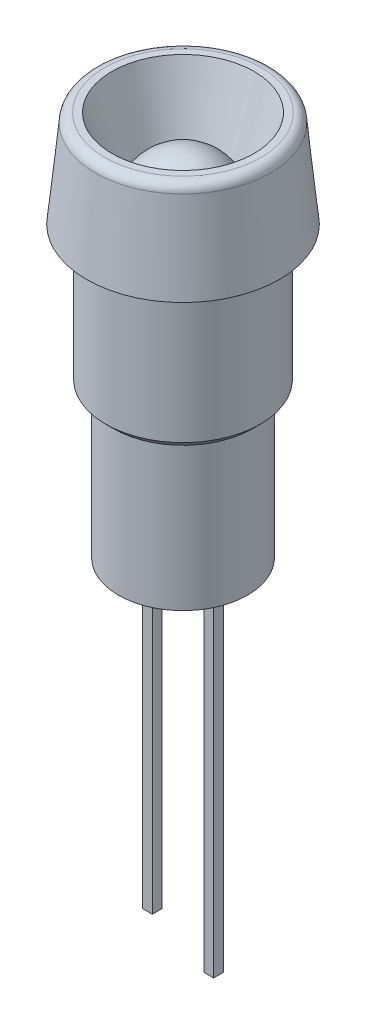
ISO-10303-21;
HEADER;
FILE_DESCRIPTION(('STEP AP214'),'2;1');
FILE_NAME('part.step','',(''),(''),'','','');
FILE_SCHEMA(('AUTOMOTIVE_DESIGN { 1 0 10303 214 1 1 1 1 }'));
ENDSEC;
DATA;
#1=APPLICATION_CONTEXT('core data for automotive mechanical design processes');
#2=APPLICATION_PROTOCOL_DEFINITION('international standard','automotive_design',2000,#1);
#3=PRODUCT_CONTEXT('',#1,'mechanical');
#4=PRODUCT('Part','Part','',(#3));
#5=PRODUCT_RELATED_PRODUCT_CATEGORY('part','',(#4));
#6=PRODUCT_DEFINITION_FORMATION('','',#4);
#7=PRODUCT_DEFINITION_CONTEXT('part definition',#1,'design');
#8=PRODUCT_DEFINITION('design','',#6,#7);
#9=PRODUCT_DEFINITION_SHAPE('','',#8);
#10=(LENGTH_UNIT() NAMED_UNIT(*) SI_UNIT(.MILLI.,.METRE.));
#11=(NAMED_UNIT(*) PLANE_ANGLE_UNIT() SI_UNIT($,.RADIAN.));
#12=(NAMED_UNIT(*) SI_UNIT($,.STERADIAN.) SOLID_ANGLE_UNIT());
#13=UNCERTAINTY_MEASURE_WITH_UNIT(LENGTH_MEASURE(1.E-05),#10,'distance_accuracy_value','');
#14=(GEOMETRIC_REPRESENTATION_CONTEXT(3) GLOBAL_UNCERTAINTY_ASSIGNED_CONTEXT((#13)) GLOBAL_UNIT_ASSIGNED_CONTEXT((#10,
#11,#12)) REPRESENTATION_CONTEXT('',''));
#15=CARTESIAN_POINT('',(0.,0.,0.));
#16=DIRECTION('',(0.,0.,1.));
#17=DIRECTION('',(1.,0.,0.));
#18=AXIS2_PLACEMENT_3D('',#15,#16,#17);
#19=CARTESIAN_POINT('',(0.,-16.51,0.));
#20=DIRECTION('',(0.,-1.,0.));
#21=DIRECTION('',(0.,0.,-1.));
#22=AXIS2_PLACEMENT_3D('',#19,#20,#21);
#23=PLANE('',#22);
#24=DIRECTION('',(0.,0.,-1.));
#25=VECTOR('',#24,1.);
#26=CARTESIAN_POINT('',(-1.84149999999992,-16.51,0.254));
#27=LINE('',#26,#25);
#28=CARTESIAN_POINT('',(-1.84149999999992,-16.51,0.254));
#29=VERTEX_POINT('',#28);
#30=CARTESIAN_POINT('',(-1.84149999999992,-16.51,-0.254));
#31=VERTEX_POINT('',#30);
#32=EDGE_CURVE('E186',#29,#31,#27,.T.);
#33=ORIENTED_EDGE('',*,*,#32,.T.);
#34=DIRECTION('',(1.,0.,0.));
#35=VECTOR('',#34,1.);
#36=CARTESIAN_POINT('',(-1.84149999999992,-16.51,-0.254));
#37=LINE('',#36,#35);
#38=CARTESIAN_POINT('',(-1.33349999999992,-16.51,-0.254));
#39=VERTEX_POINT('',#38);
#40=EDGE_CURVE('E169',#31,#39,#37,.T.);
#41=ORIENTED_EDGE('',*,*,#40,.T.);
#42=DIRECTION('',(0.,0.,1.));
#43=VECTOR('',#42,1.);
#44=CARTESIAN_POINT('',(-1.33349999999992,-16.51,0.254));
#45=LINE('',#44,#43);
#46=CARTESIAN_POINT('',(-1.33349999999992,-16.51,0.254));
#47=VERTEX_POINT('',#46);
#48=EDGE_CURVE('E27',#39,#47,#45,.T.);
#49=ORIENTED_EDGE('',*,*,#48,.T.);
#50=DIRECTION('',(-1.,0.,0.));
#51=VECTOR('',#50,1.);
#52=CARTESIAN_POINT('',(-1.84149999999992,-16.51,0.254));
#53=LINE('',#52,#51);
#54=EDGE_CURVE('E11',#47,#29,#53,.T.);
#55=ORIENTED_EDGE('',*,*,#54,.T.);
#56=EDGE_LOOP('',(#33,#41,#49,#55));
#57=FACE_BOUND('',#56,.T.);
#58=ADVANCED_FACE('F18',(#57),#23,.T.);
#59=CARTESIAN_POINT('',(-1.84149999999992,-16.51,0.254));
#60=DIRECTION('',(0.,0.,-1.));
#61=DIRECTION('',(0.,-1.,0.));
#62=AXIS2_PLACEMENT_3D('',#59,#60,#61);
#63=PLANE('',#62);
#64=DIRECTION('',(-1.,0.,0.));
#65=VECTOR('',#64,1.);
#66=CARTESIAN_POINT('',(-1.8415,0.,0.254));
#67=LINE('',#66,#65);
#68=CARTESIAN_POINT('',(-1.33349999999992,0.,0.254));
#69=VERTEX_POINT('',#68);
#70=CARTESIAN_POINT('',(-1.8415,0.,0.254));
#71=VERTEX_POINT('',#70);
#72=EDGE_CURVE('E161',#69,#71,#67,.T.);
#73=ORIENTED_EDGE('',*,*,#72,.T.);
#74=DIRECTION('',(0.,1.,0.));
#75=VECTOR('',#74,1.);
#76=CARTESIAN_POINT('',(-1.84149999999992,-16.51,0.254));
#77=LINE('',#76,#75);
#78=EDGE_CURVE('E190',#29,#71,#77,.T.);
#79=ORIENTED_EDGE('',*,*,#78,.F.);
#80=ORIENTED_EDGE('',*,*,#54,.F.);
#81=DIRECTION('',(0.,1.,0.));
#82=VECTOR('',#81,1.);
#83=CARTESIAN_POINT('',(-1.33349999999992,-16.51,0.254));
#84=LINE('',#83,#82);
#85=EDGE_CURVE('E21',#47,#69,#84,.T.);
#86=ORIENTED_EDGE('',*,*,#85,.T.);
#87=EDGE_LOOP('',(#73,#79,#80,#86));
#88=FACE_BOUND('',#87,.T.);
#89=ADVANCED_FACE('F207',(#88),#63,.F.);
#90=CARTESIAN_POINT('',(-1.33349999999992,-16.51,0.254));
#91=DIRECTION('',(-1.,0.,0.));
#92=DIRECTION('',(0.,1.,0.));
#93=AXIS2_PLACEMENT_3D('',#90,#91,#92);
#94=PLANE('',#93);
#95=DIRECTION('',(0.,0.,1.));
#96=VECTOR('',#95,1.);
#97=CARTESIAN_POINT('',(-1.3335,0.,0.254));
#98=LINE('',#97,#96);
#99=CARTESIAN_POINT('',(-1.3335,0.,-0.254));
#100=VERTEX_POINT('',#99);
#101=EDGE_CURVE('E165',#100,#69,#98,.T.);
#102=ORIENTED_EDGE('',*,*,#101,.T.);
#103=ORIENTED_EDGE('',*,*,#85,.F.);
#104=ORIENTED_EDGE('',*,*,#48,.F.);
#105=DIRECTION('',(0.,1.,0.));
#106=VECTOR('',#105,1.);
#107=CARTESIAN_POINT('',(-1.33349999999992,-16.51,-0.254));
#108=LINE('',#107,#106);
#109=EDGE_CURVE('E172',#39,#100,#108,.T.);
#110=ORIENTED_EDGE('',*,*,#109,.T.);
#111=EDGE_LOOP('',(#102,#103,#104,#110));
#112=FACE_BOUND('',#111,.T.);
#113=ADVANCED_FACE('F196',(#112),#94,.F.);
#114=CARTESIAN_POINT('',(-1.84149999999992,-16.51,-0.254));
#115=DIRECTION('',(0.,0.,1.));
#116=DIRECTION('',(1.,0.,0.));
#117=AXIS2_PLACEMENT_3D('',#114,#115,#116);
#118=PLANE('',#117);
#119=DIRECTION('',(1.,0.,0.));
#120=VECTOR('',#119,1.);
#121=CARTESIAN_POINT('',(-1.8415,0.,-0.254));
#122=LINE('',#121,#120);
#123=CARTESIAN_POINT('',(-1.8415,0.,-0.254));
#124=VERTEX_POINT('',#123);
#125=EDGE_CURVE('E126',#124,#100,#122,.T.);
#126=ORIENTED_EDGE('',*,*,#125,.T.);
#127=ORIENTED_EDGE('',*,*,#109,.F.);
#128=ORIENTED_EDGE('',*,*,#40,.F.);
#129=DIRECTION('',(0.,1.,0.));
#130=VECTOR('',#129,1.);
#131=CARTESIAN_POINT('',(-1.84149999999992,-16.51,-0.254));
#132=LINE('',#131,#130);
#133=EDGE_CURVE('E176',#31,#124,#132,.T.);
#134=ORIENTED_EDGE('',*,*,#133,.T.);
#135=EDGE_LOOP('',(#126,#127,#128,#134));
#136=FACE_BOUND('',#135,.T.);
#137=ADVANCED_FACE('F202',(#136),#118,.F.);
#138=CARTESIAN_POINT('',(-1.84149999999992,-16.51,0.254));
#139=DIRECTION('',(1.,0.,0.));
#140=DIRECTION('',(0.,1.,0.));
#141=AXIS2_PLACEMENT_3D('',#138,#139,#140);
#142=PLANE('',#141);
#143=DIRECTION('',(0.,0.,-1.));
#144=VECTOR('',#143,1.);
#145=CARTESIAN_POINT('',(-1.8415,0.,0.254));
#146=LINE('',#145,#144);
#147=EDGE_CURVE('E157',#71,#124,#146,.T.);
#148=ORIENTED_EDGE('',*,*,#147,.T.);
#149=ORIENTED_EDGE('',*,*,#133,.F.);
#150=ORIENTED_EDGE('',*,*,#32,.F.);
#151=ORIENTED_EDGE('',*,*,#78,.T.);
#152=EDGE_LOOP('',(#148,#149,#150,#151));
#153=FACE_BOUND('',#152,.T.);
#154=ADVANCED_FACE('F206',(#153),#142,.F.);
#155=CARTESIAN_POINT('',(0.,-17.78,0.));
#156=DIRECTION('',(0.,-1.,0.));
#157=DIRECTION('',(0.,0.,-1.));
#158=AXIS2_PLACEMENT_3D('',#155,#156,#157);
#159=PLANE('',#158);
#160=DIRECTION('',(0.,0.,-1.));
#161=VECTOR('',#160,1.);
#162=CARTESIAN_POINT('',(1.33350000000009,-17.78,0.254));
#163=LINE('',#162,#161);
#164=CARTESIAN_POINT('',(1.33350000000009,-17.78,0.254));
#165=VERTEX_POINT('',#164);
#166=CARTESIAN_POINT('',(1.33350000000009,-17.78,-0.254));
#167=VERTEX_POINT('',#166);
#168=EDGE_CURVE('E150',#165,#167,#163,.T.);
#169=ORIENTED_EDGE('',*,*,#168,.T.);
#170=DIRECTION('',(1.,0.,0.));
#171=VECTOR('',#170,1.);
#172=CARTESIAN_POINT('',(1.33350000000009,-17.78,-0.254));
#173=LINE('',#172,#171);
#174=CARTESIAN_POINT('',(1.84150000000008,-17.78,-0.254));
#175=VERTEX_POINT('',#174);
#176=EDGE_CURVE('E114',#167,#175,#173,.T.);
#177=ORIENTED_EDGE('',*,*,#176,.T.);
#178=DIRECTION('',(0.,0.,1.));
#179=VECTOR('',#178,1.);
#180=CARTESIAN_POINT('',(1.84150000000008,-17.78,0.254));
#181=LINE('',#180,#179);
#182=CARTESIAN_POINT('',(1.84150000000008,-17.78,0.254));
#183=VERTEX_POINT('',#182);
#184=EDGE_CURVE('E109',#175,#183,#181,.T.);
#185=ORIENTED_EDGE('',*,*,#184,.T.);
#186=DIRECTION('',(-1.,0.,0.));
#187=VECTOR('',#186,1.);
#188=CARTESIAN_POINT('',(1.33350000000009,-17.78,0.254));
#189=LINE('',#188,#187);
#190=EDGE_CURVE('E173',#183,#165,#189,.T.);
#191=ORIENTED_EDGE('',*,*,#190,.T.);
#192=EDGE_LOOP('',(#169,#177,#185,#191));
#193=FACE_BOUND('',#192,.T.);
#194=ADVANCED_FACE('F455',(#193),#159,.T.);
#195=CARTESIAN_POINT('',(1.33350000000009,-17.78,0.254));
#196=DIRECTION('',(0.,0.,-1.));
#197=DIRECTION('',(0.,-1.,0.));
#198=AXIS2_PLACEMENT_3D('',#195,#196,#197);
#199=PLANE('',#198);
#200=DIRECTION('',(-1.,0.,0.));
#201=VECTOR('',#200,1.);
#202=CARTESIAN_POINT('',(1.3335,0.,0.254));
#203=LINE('',#202,#201);
#204=CARTESIAN_POINT('',(1.84150000000008,0.,0.254));
#205=VERTEX_POINT('',#204);
#206=CARTESIAN_POINT('',(1.3335,0.,0.254));
#207=VERTEX_POINT('',#206);
#208=EDGE_CURVE('E124',#205,#207,#203,.T.);
#209=ORIENTED_EDGE('',*,*,#208,.T.);
#210=DIRECTION('',(0.,1.,0.));
#211=VECTOR('',#210,1.);
#212=CARTESIAN_POINT('',(1.33350000000009,-17.78,0.254));
#213=LINE('',#212,#211);
#214=EDGE_CURVE('E115',#165,#207,#213,.T.);
#215=ORIENTED_EDGE('',*,*,#214,.F.);
#216=ORIENTED_EDGE('',*,*,#190,.F.);
#217=DIRECTION('',(0.,1.,0.));
#218=VECTOR('',#217,1.);
#219=CARTESIAN_POINT('',(1.84150000000008,-17.78,0.254));
#220=LINE('',#219,#218);
#221=EDGE_CURVE('E181',#183,#205,#220,.T.);
#222=ORIENTED_EDGE('',*,*,#221,.T.);
#223=EDGE_LOOP('',(#209,#215,#216,#222));
#224=FACE_BOUND('',#223,.T.);
#225=ADVANCED_FACE('F447',(#224),#199,.F.);
#226=CARTESIAN_POINT('',(1.84150000000008,-17.78,0.254));
#227=DIRECTION('',(-1.,0.,0.));
#228=DIRECTION('',(0.,1.,0.));
#229=AXIS2_PLACEMENT_3D('',#226,#227,#228);
#230=PLANE('',#229);
#231=DIRECTION('',(0.,0.,1.));
#232=VECTOR('',#231,1.);
#233=CARTESIAN_POINT('',(1.8415,0.,0.254));
#234=LINE('',#233,#232);
#235=CARTESIAN_POINT('',(1.8415,0.,-0.254));
#236=VERTEX_POINT('',#235);
#237=EDGE_CURVE('E106',#236,#205,#234,.T.);
#238=ORIENTED_EDGE('',*,*,#237,.T.);
#239=ORIENTED_EDGE('',*,*,#221,.F.);
#240=ORIENTED_EDGE('',*,*,#184,.F.);
#241=DIRECTION('',(0.,1.,0.));
#242=VECTOR('',#241,1.);
#243=CARTESIAN_POINT('',(1.84150000000008,-17.78,-0.254));
#244=LINE('',#243,#242);
#245=EDGE_CURVE('E102',#175,#236,#244,.T.);
#246=ORIENTED_EDGE('',*,*,#245,.T.);
#247=EDGE_LOOP('',(#238,#239,#240,#246));
#248=FACE_BOUND('',#247,.T.);
#249=ADVANCED_FACE('F104',(#248),#230,.F.);
#250=CARTESIAN_POINT('',(1.33350000000009,-17.78,-0.254));
#251=DIRECTION('',(0.,0.,1.));
#252=DIRECTION('',(1.,0.,0.));
#253=AXIS2_PLACEMENT_3D('',#250,#251,#252);
#254=PLANE('',#253);
#255=DIRECTION('',(1.,0.,0.));
#256=VECTOR('',#255,1.);
#257=CARTESIAN_POINT('',(1.3335,0.,-0.254));
#258=LINE('',#257,#256);
#259=CARTESIAN_POINT('',(1.3335,0.,-0.254));
#260=VERTEX_POINT('',#259);
#261=EDGE_CURVE('E122',#260,#236,#258,.T.);
#262=ORIENTED_EDGE('',*,*,#261,.T.);
#263=ORIENTED_EDGE('',*,*,#245,.F.);
#264=ORIENTED_EDGE('',*,*,#176,.F.);
#265=DIRECTION('',(0.,1.,0.));
#266=VECTOR('',#265,1.);
#267=CARTESIAN_POINT('',(1.33350000000009,-17.78,-0.254));
#268=LINE('',#267,#266);
#269=EDGE_CURVE('E130',#167,#260,#268,.T.);
#270=ORIENTED_EDGE('',*,*,#269,.T.);
#271=EDGE_LOOP('',(#262,#263,#264,#270));
#272=FACE_BOUND('',#271,.T.);
#273=ADVANCED_FACE('F128',(#272),#254,.F.);
#274=CARTESIAN_POINT('',(1.33350000000009,-17.78,0.254));
#275=DIRECTION('',(1.,0.,0.));
#276=DIRECTION('',(0.,1.,0.));
#277=AXIS2_PLACEMENT_3D('',#274,#275,#276);
#278=PLANE('',#277);
#279=DIRECTION('',(0.,0.,-1.));
#280=VECTOR('',#279,1.);
#281=CARTESIAN_POINT('',(1.3335,0.,0.254));
#282=LINE('',#281,#280);
#283=EDGE_CURVE('E133',#207,#260,#282,.T.);
#284=ORIENTED_EDGE('',*,*,#283,.T.);
#285=ORIENTED_EDGE('',*,*,#269,.F.);
#286=ORIENTED_EDGE('',*,*,#168,.F.);
#287=ORIENTED_EDGE('',*,*,#214,.T.);
#288=EDGE_LOOP('',(#284,#285,#286,#287));
#289=FACE_BOUND('',#288,.T.);
#290=ADVANCED_FACE('F423',(#289),#278,.F.);
#291=CARTESIAN_POINT('',(4.00241928629269,14.9733199644002,0.));
#292=DIRECTION('',(0.,-1.,0.));
#293=DIRECTION('',(0.,0.,-1.));
#294=AXIS2_PLACEMENT_3D('',#291,#292,#293);
#295=PLANE('',#294);
#296=CARTESIAN_POINT('',(0.,14.9733199644001,0.));
#297=DIRECTION('',(0.,-1.,0.));
#298=DIRECTION('',(1.,0.,0.));
#299=AXIS2_PLACEMENT_3D('',#296,#297,#298);
#300=CIRCLE('',#299,4.00241928629276);
#301=CARTESIAN_POINT('',(4.00241928629268,14.9733199644002,0.));
#302=VERTEX_POINT('',#301);
#303=EDGE_CURVE('E134',#302,#302,#300,.T.);
#304=ORIENTED_EDGE('',*,*,#303,.F.);
#305=EDGE_LOOP('',(#304));
#306=FACE_BOUND('',#305,.T.);
#307=CARTESIAN_POINT('',(0.,14.9733199644001,0.));
#308=DIRECTION('',(0.,-1.,0.));
#309=DIRECTION('',(1.,0.,0.));
#310=AXIS2_PLACEMENT_3D('',#307,#308,#309);
#311=CIRCLE('',#310,4.99108003559997);
#312=CARTESIAN_POINT('',(4.9910800355999,14.9733199644002,0.));
#313=VERTEX_POINT('',#312);
#314=EDGE_CURVE('E252',#313,#313,#311,.T.);
#315=ORIENTED_EDGE('',*,*,#314,.T.);
#316=EDGE_LOOP('',(#315));
#317=FACE_BOUND('',#316,.T.);
#318=ADVANCED_FACE('F381',(#306,#317),#295,.T.);
#319=CARTESIAN_POINT('',(0.,19.9644,0.));
#320=DIRECTION('',(0.,1.,0.));
#321=DIRECTION('',(1.,0.,0.));
#322=AXIS2_PLACEMENT_3D('',#319,#320,#321);
#323=PLANE('',#322);
#324=CARTESIAN_POINT('',(0.,19.9644,0.));
#325=DIRECTION('',(0.,-1.,0.));
#326=DIRECTION('',(0.,0.,-1.));
#327=AXIS2_PLACEMENT_3D('',#324,#325,#326);
#328=CIRCLE('',#327,3.67970764536876);
#329=CARTESIAN_POINT('',(0.,19.9644,-3.67970764536876));
#330=VERTEX_POINT('',#329);
#331=EDGE_CURVE('E272',#330,#330,#328,.T.);
#332=ORIENTED_EDGE('',*,*,#331,.T.);
#333=EDGE_LOOP('',(#332));
#334=FACE_BOUND('',#333,.T.);
#335=CARTESIAN_POINT('',(0.,19.9644,0.));
#336=DIRECTION('',(0.,-1.,0.));
#337=DIRECTION('',(1.,0.,0.));
#338=AXIS2_PLACEMENT_3D('',#335,#336,#337);
#339=CIRCLE('',#338,4.04030003985646);
#340=CARTESIAN_POINT('',(4.04030003985636,19.9644,0.));
#341=VERTEX_POINT('',#340);
#342=EDGE_CURVE('E255',#341,#341,#339,.T.);
#343=ORIENTED_EDGE('',*,*,#342,.F.);
#344=EDGE_LOOP('',(#343));
#345=FACE_BOUND('',#344,.T.);
#346=ADVANCED_FACE('F363',(#334,#345),#323,.T.);
#347=CARTESIAN_POINT('',(3.34402362385197,7.58647998576154,0.));
#348=DIRECTION('',(0.,-1.,0.));
#349=DIRECTION('',(0.,0.,-1.));
#350=AXIS2_PLACEMENT_3D('',#347,#348,#349);
#351=PLANE('',#350);
#352=CARTESIAN_POINT('',(0.,7.58647998576152,0.));
#353=DIRECTION('',(0.,-1.,0.));
#354=DIRECTION('',(1.,0.,0.));
#355=AXIS2_PLACEMENT_3D('',#352,#353,#354);
#356=CIRCLE('',#355,3.344023623852);
#357=CARTESIAN_POINT('',(3.34402362385196,7.58647998576154,0.));
#358=VERTEX_POINT('',#357);
#359=EDGE_CURVE('E284',#358,#358,#356,.T.);
#360=ORIENTED_EDGE('',*,*,#359,.F.);
#361=EDGE_LOOP('',(#360));
#362=FACE_BOUND('',#361,.T.);
#363=CARTESIAN_POINT('',(0.,7.58647998576152,0.));
#364=DIRECTION('',(0.,-1.,0.));
#365=DIRECTION('',(1.,0.,0.));
#366=AXIS2_PLACEMENT_3D('',#363,#364,#365);
#367=CIRCLE('',#366,3.59357762563218);
#368=CARTESIAN_POINT('',(3.59357762563214,7.58647998576154,0.));
#369=VERTEX_POINT('',#368);
#370=EDGE_CURVE('E740',#369,#369,#367,.T.);
#371=ORIENTED_EDGE('',*,*,#370,.T.);
#372=EDGE_LOOP('',(#371));
#373=FACE_BOUND('',#372,.T.);
#374=ADVANCED_FACE('F359',(#362,#373),#351,.T.);
#375=CARTESIAN_POINT('',(0.,0.,0.));
#376=DIRECTION('',(0.,-1.,0.));
#377=DIRECTION('',(0.,0.,-1.));
#378=AXIS2_PLACEMENT_3D('',#375,#376,#377);
#379=PLANE('',#378);
#380=ORIENTED_EDGE('',*,*,#125,.F.);
#381=ORIENTED_EDGE('',*,*,#147,.F.);
#382=ORIENTED_EDGE('',*,*,#72,.F.);
#383=ORIENTED_EDGE('',*,*,#101,.F.);
#384=EDGE_LOOP('',(#380,#381,#382,#383));
#385=FACE_BOUND('',#384,.T.);
#386=ORIENTED_EDGE('',*,*,#261,.F.);
#387=ORIENTED_EDGE('',*,*,#283,.F.);
#388=ORIENTED_EDGE('',*,*,#208,.F.);
#389=ORIENTED_EDGE('',*,*,#237,.F.);
#390=EDGE_LOOP('',(#386,#387,#388,#389));
#391=FACE_BOUND('',#390,.T.);
#392=CARTESIAN_POINT('',(0.,0.,0.));
#393=DIRECTION('',(0.,-1.,0.));
#394=DIRECTION('',(1.,0.,0.));
#395=AXIS2_PLACEMENT_3D('',#392,#393,#394);
#396=CIRCLE('',#395,3.34402362385197);
#397=CARTESIAN_POINT('',(3.34402362385197,0.,0.));
#398=VERTEX_POINT('',#397);
#399=EDGE_CURVE('E743',#398,#398,#396,.T.);
#400=ORIENTED_EDGE('',*,*,#399,.T.);
#401=EDGE_LOOP('',(#400));
#402=FACE_BOUND('',#401,.T.);
#403=ADVANCED_FACE('F119',(#385,#391,#402),#379,.T.);
#404=CARTESIAN_POINT('',(0.,0.,0.));
#405=DIRECTION('',(0.,-1.,0.));
#406=DIRECTION('',(1.,0.,0.));
#407=AXIS2_PLACEMENT_3D('',#404,#405,#406);
#408=CYLINDRICAL_SURFACE('',#407,4.00241928629274);
#409=CARTESIAN_POINT('',(0.,7.99532164642206,0.));
#410=DIRECTION('',(0.,-1.,0.));
#411=DIRECTION('',(1.,0.,0.));
#412=AXIS2_PLACEMENT_3D('',#409,#410,#411);
#413=CIRCLE('',#412,4.00241928629273);
#414=CARTESIAN_POINT('',(4.00241928629269,7.99532164642208,0.));
#415=VERTEX_POINT('',#414);
#416=EDGE_CURVE('E143',#415,#415,#413,.T.);
#417=ORIENTED_EDGE('',*,*,#416,.F.);
#418=EDGE_LOOP('',(#417));
#419=FACE_BOUND('',#418,.T.);
#420=ORIENTED_EDGE('',*,*,#303,.T.);
#421=EDGE_LOOP('',(#420));
#422=FACE_BOUND('',#421,.T.);
#423=ADVANCED_FACE('F390',(#419,#422),#408,.T.);
#424=CARTESIAN_POINT('',(0.,7.58647998576152,0.));
#425=DIRECTION('',(0.,1.,0.));
#426=DIRECTION('',(-1.,0.,0.));
#427=AXIS2_PLACEMENT_3D('',#424,#425,#426);
#428=CONICAL_SURFACE('',#427,3.59357762563218,0.785398163397445);
#429=ORIENTED_EDGE('',*,*,#416,.T.);
#430=EDGE_LOOP('',(#429));
#431=FACE_BOUND('',#430,.T.);
#432=ORIENTED_EDGE('',*,*,#370,.F.);
#433=EDGE_LOOP('',(#432));
#434=FACE_BOUND('',#433,.T.);
#435=ADVANCED_FACE('F398',(#431,#434),#428,.T.);
#436=CARTESIAN_POINT('',(0.,0.,0.));
#437=DIRECTION('',(0.,-1.,0.));
#438=DIRECTION('',(1.,0.,0.));
#439=AXIS2_PLACEMENT_3D('',#436,#437,#438);
#440=CYLINDRICAL_SURFACE('',#439,3.34402362385199);
#441=ORIENTED_EDGE('',*,*,#399,.F.);
#442=EDGE_LOOP('',(#441));
#443=FACE_BOUND('',#442,.T.);
#444=ORIENTED_EDGE('',*,*,#359,.T.);
#445=EDGE_LOOP('',(#444));
#446=FACE_BOUND('',#445,.T.);
#447=ADVANCED_FACE('F372',(#443,#446),#440,.T.);
#448=CARTESIAN_POINT('',(0.,19.4913591709972,0.));
#449=DIRECTION('',(0.,-1.,0.));
#450=DIRECTION('',(1.,0.,0.));
#451=AXIS2_PLACEMENT_3D('',#448,#449,#450);
#452=TOROIDAL_SURFACE('',#451,4.06389239987465,0.473628784339516);
#453=CARTESIAN_POINT('',(0.,19.5149515310154,0.));
#454=DIRECTION('',(0.,-1.,0.));
#455=DIRECTION('',(1.,0.,0.));
#456=AXIS2_PLACEMENT_3D('',#453,#454,#455);
#457=CIRCLE('',#456,4.53693322887749);
#458=CARTESIAN_POINT('',(4.5369332288774,19.5149515310154,0.));
#459=VERTEX_POINT('',#458);
#460=EDGE_CURVE('E256',#459,#459,#457,.T.);
#461=ORIENTED_EDGE('',*,*,#460,.F.);
#462=EDGE_LOOP('',(#461));
#463=FACE_BOUND('',#462,.T.);
#464=ORIENTED_EDGE('',*,*,#342,.T.);
#465=EDGE_LOOP('',(#464));
#466=FACE_BOUND('',#465,.T.);
#467=ADVANCED_FACE('F353',(#463,#466),#452,.T.);
#468=CARTESIAN_POINT('',(0.,14.9733199644001,0.));
#469=DIRECTION('',(0.,-1.,0.));
#470=DIRECTION('',(1.,0.,0.));
#471=AXIS2_PLACEMENT_3D('',#468,#469,#470);
#472=CONICAL_SURFACE('',#471,4.99108003559997,0.0996650881191985);
#473=ORIENTED_EDGE('',*,*,#314,.F.);
#474=EDGE_LOOP('',(#473));
#475=FACE_BOUND('',#474,.T.);
#476=ORIENTED_EDGE('',*,*,#460,.T.);
#477=EDGE_LOOP('',(#476));
#478=FACE_BOUND('',#477,.T.);
#479=ADVANCED_FACE('F334',(#475,#478),#472,.T.);
#480=CARTESIAN_POINT('',(0.,15.6464,0.));
#481=DIRECTION('',(0.,0.,1.));
#482=DIRECTION('',(1.,0.,0.));
#483=AXIS2_PLACEMENT_3D('',#480,#481,#482);
#484=SPHERICAL_SURFACE('',#483,2.54);
#485=CARTESIAN_POINT('',(0.,15.6464,0.));
#486=DIRECTION('',(0.,-1.,0.));
#487=DIRECTION('',(0.,0.,-1.));
#488=AXIS2_PLACEMENT_3D('',#485,#486,#487);
#489=SPHERICAL_SURFACE('',#488,2.54);
#490=CARTESIAN_POINT('',(0.,16.2601111548796,0.));
#491=DIRECTION('',(0.,-1.,0.));
#492=DIRECTION('',(0.,0.,-1.));
#493=AXIS2_PLACEMENT_3D('',#490,#491,#492);
#494=CIRCLE('',#493,2.46474311407423);
#495=CARTESIAN_POINT('',(0.,16.2601111548796,-2.46474311407423));
#496=VERTEX_POINT('',#495);
#497=EDGE_CURVE('E268',#496,#496,#494,.T.);
#498=ORIENTED_EDGE('',*,*,#497,.F.);
#499=EDGE_LOOP('',(#498));
#500=FACE_BOUND('',#499,.T.);
#501=ADVANCED_FACE('F325',(#500),#489,.T.);
#502=CARTESIAN_POINT('',(0.,16.2601111548796,0.));
#503=DIRECTION('',(0.,1.,0.));
#504=DIRECTION('',(0.,0.,1.));
#505=AXIS2_PLACEMENT_3D('',#502,#503,#504);
#506=CONICAL_SURFACE('',#505,2.46474311407423,0.316932611050187);
#507=ORIENTED_EDGE('',*,*,#331,.F.);
#508=EDGE_LOOP('',(#507));
#509=FACE_BOUND('',#508,.T.);
#510=ORIENTED_EDGE('',*,*,#497,.T.);
#511=EDGE_LOOP('',(#510));
#512=FACE_BOUND('',#511,.T.);
#513=ADVANCED_FACE('F321',(#509,#512),#506,.F.);
#514=CLOSED_SHELL('',(#58,#89,#113,#137,#154,#194,#225,#249,#273,#290,#318,#346,#374,#403,#423,
#435,#447,#467,#479,#501,#513));
#515=MANIFOLD_SOLID_BREP('B1',#514);
#516=ADVANCED_BREP_SHAPE_REPRESENTATION('',(#18,#515),#14);
#517=SHAPE_DEFINITION_REPRESENTATION(#9,#516);
ENDSEC;
END-ISO-10303-21;
